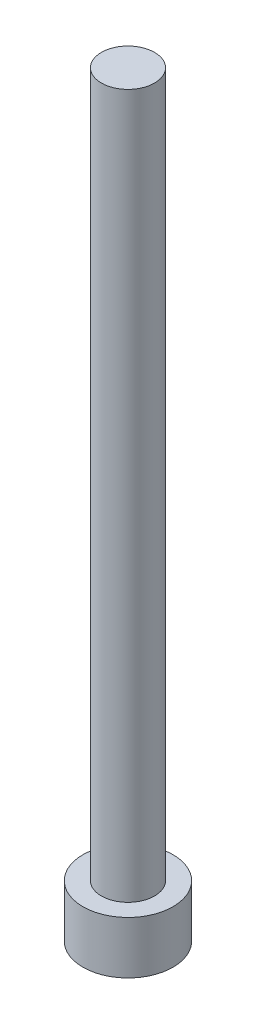
ISO-10303-21;
HEADER;
FILE_DESCRIPTION(('STEP AP214'),'2;1');
FILE_NAME('part.step','',(''),(''),'','','');
FILE_SCHEMA(('AUTOMOTIVE_DESIGN { 1 0 10303 214 1 1 1 1 }'));
ENDSEC;
DATA;
#1=APPLICATION_CONTEXT('core data for automotive mechanical design processes');
#2=APPLICATION_PROTOCOL_DEFINITION('international standard','automotive_design',2000,#1);
#3=PRODUCT_CONTEXT('',#1,'mechanical');
#4=PRODUCT('Part','Part','',(#3));
#5=PRODUCT_RELATED_PRODUCT_CATEGORY('part','',(#4));
#6=PRODUCT_DEFINITION_FORMATION('','',#4);
#7=PRODUCT_DEFINITION_CONTEXT('part definition',#1,'design');
#8=PRODUCT_DEFINITION('design','',#6,#7);
#9=PRODUCT_DEFINITION_SHAPE('','',#8);
#10=(LENGTH_UNIT() NAMED_UNIT(*) SI_UNIT(.MILLI.,.METRE.));
#11=(NAMED_UNIT(*) PLANE_ANGLE_UNIT() SI_UNIT($,.RADIAN.));
#12=(NAMED_UNIT(*) SI_UNIT($,.STERADIAN.) SOLID_ANGLE_UNIT());
#13=UNCERTAINTY_MEASURE_WITH_UNIT(LENGTH_MEASURE(1.E-05),#10,'distance_accuracy_value','');
#14=(GEOMETRIC_REPRESENTATION_CONTEXT(3) GLOBAL_UNCERTAINTY_ASSIGNED_CONTEXT((#13)) GLOBAL_UNIT_ASSIGNED_CONTEXT((#10,
#11,#12)) REPRESENTATION_CONTEXT('',''));
#15=CARTESIAN_POINT('',(0.,0.,0.));
#16=DIRECTION('',(0.,0.,1.));
#17=DIRECTION('',(1.,0.,0.));
#18=AXIS2_PLACEMENT_3D('',#15,#16,#17);
#19=CARTESIAN_POINT('',(0.,7.45,0.));
#20=DIRECTION('',(0.,-1.,0.));
#21=DIRECTION('',(0.,0.,-1.));
#22=AXIS2_PLACEMENT_3D('',#19,#20,#21);
#23=CYLINDRICAL_SURFACE('',#22,6.4);
#24=CARTESIAN_POINT('',(0.,7.45,0.));
#25=DIRECTION('',(0.,1.,0.));
#26=DIRECTION('',(0.,0.,1.));
#27=AXIS2_PLACEMENT_3D('',#24,#25,#26);
#28=CIRCLE('',#27,6.4);
#29=CARTESIAN_POINT('',(0.,7.45,6.4));
#30=VERTEX_POINT('',#29);
#31=EDGE_CURVE('E185',#30,#30,#28,.T.);
#32=ORIENTED_EDGE('',*,*,#31,.F.);
#33=EDGE_LOOP('',(#32));
#34=FACE_BOUND('',#33,.T.);
#35=CARTESIAN_POINT('',(0.,0.,0.));
#36=DIRECTION('',(0.,1.,0.));
#37=DIRECTION('',(0.,0.,1.));
#38=AXIS2_PLACEMENT_3D('',#35,#36,#37);
#39=CIRCLE('',#38,6.4);
#40=CARTESIAN_POINT('',(0.,0.,6.4));
#41=VERTEX_POINT('',#40);
#42=EDGE_CURVE('E188',#41,#41,#39,.T.);
#43=ORIENTED_EDGE('',*,*,#42,.T.);
#44=EDGE_LOOP('',(#43));
#45=FACE_BOUND('',#44,.T.);
#46=ADVANCED_FACE('F45',(#34,#45),#23,.T.);
#47=CARTESIAN_POINT('',(0.,7.45,0.));
#48=DIRECTION('',(0.,1.,0.));
#49=DIRECTION('',(0.,0.,1.));
#50=AXIS2_PLACEMENT_3D('',#47,#48,#49);
#51=PLANE('',#50);
#52=CARTESIAN_POINT('',(0.,7.45,0.));
#53=DIRECTION('',(0.,1.,0.));
#54=DIRECTION('',(0.,0.,1.));
#55=AXIS2_PLACEMENT_3D('',#52,#53,#54);
#56=CIRCLE('',#55,3.775);
#57=CARTESIAN_POINT('',(0.,7.45,3.775));
#58=VERTEX_POINT('',#57);
#59=EDGE_CURVE('E178',#58,#58,#56,.T.);
#60=ORIENTED_EDGE('',*,*,#59,.F.);
#61=EDGE_LOOP('',(#60));
#62=FACE_BOUND('',#61,.T.);
#63=ORIENTED_EDGE('',*,*,#31,.T.);
#64=EDGE_LOOP('',(#63));
#65=FACE_BOUND('',#64,.T.);
#66=ADVANCED_FACE('F330',(#62,#65),#51,.T.);
#67=CARTESIAN_POINT('',(0.,0.,0.));
#68=DIRECTION('',(0.,1.,0.));
#69=DIRECTION('',(0.,0.,1.));
#70=AXIS2_PLACEMENT_3D('',#67,#68,#69);
#71=PLANE('',#70);
#72=DIRECTION('',(0.5,0.,0.866025403784439));
#73=VECTOR('',#72,1.);
#74=CARTESIAN_POINT('',(3.13934208871859,0.,-1.8125));
#75=LINE('',#74,#73);
#76=CARTESIAN_POINT('',(4.18578945162479,0.,0.));
#77=VERTEX_POINT('',#76);
#78=CARTESIAN_POINT('',(2.09289472581239,0.,-3.625));
#79=VERTEX_POINT('',#78);
#80=EDGE_CURVE('E177',#77,#79,#75,.F.);
#81=ORIENTED_EDGE('',*,*,#80,.T.);
#82=DIRECTION('',(1.,0.,0.));
#83=VECTOR('',#82,1.);
#84=CARTESIAN_POINT('',(0.,0.,-3.625));
#85=LINE('',#84,#83);
#86=CARTESIAN_POINT('',(-2.09289472581239,0.,-3.625));
#87=VERTEX_POINT('',#86);
#88=EDGE_CURVE('E160',#79,#87,#85,.F.);
#89=ORIENTED_EDGE('',*,*,#88,.T.);
#90=DIRECTION('',(0.5,0.,-0.866025403784438));
#91=VECTOR('',#90,1.);
#92=CARTESIAN_POINT('',(-3.13934208871859,0.,-1.8125));
#93=LINE('',#92,#91);
#94=CARTESIAN_POINT('',(-4.18578945162479,0.,0.));
#95=VERTEX_POINT('',#94);
#96=EDGE_CURVE('E199',#87,#95,#93,.F.);
#97=ORIENTED_EDGE('',*,*,#96,.T.);
#98=DIRECTION('',(-0.5,0.,-0.866025403784439));
#99=VECTOR('',#98,1.);
#100=CARTESIAN_POINT('',(-3.13934208871859,0.,1.8125));
#101=LINE('',#100,#99);
#102=CARTESIAN_POINT('',(-2.09289472581239,0.,3.625));
#103=VERTEX_POINT('',#102);
#104=EDGE_CURVE('E196',#95,#103,#101,.F.);
#105=ORIENTED_EDGE('',*,*,#104,.T.);
#106=DIRECTION('',(-1.,0.,0.));
#107=VECTOR('',#106,1.);
#108=CARTESIAN_POINT('',(0.,0.,3.625));
#109=LINE('',#108,#107);
#110=CARTESIAN_POINT('',(2.09289472581239,0.,3.625));
#111=VERTEX_POINT('',#110);
#112=EDGE_CURVE('E193',#103,#111,#109,.F.);
#113=ORIENTED_EDGE('',*,*,#112,.T.);
#114=DIRECTION('',(-0.5,0.,0.866025403784439));
#115=VECTOR('',#114,1.);
#116=CARTESIAN_POINT('',(3.13934208871859,0.,1.8125));
#117=LINE('',#116,#115);
#118=EDGE_CURVE('E182',#111,#77,#117,.F.);
#119=ORIENTED_EDGE('',*,*,#118,.T.);
#120=EDGE_LOOP('',(#81,#89,#97,#105,#113,#119));
#121=FACE_BOUND('',#120,.T.);
#122=ORIENTED_EDGE('',*,*,#42,.F.);
#123=EDGE_LOOP('',(#122));
#124=FACE_BOUND('',#123,.T.);
#125=ADVANCED_FACE('F327',(#121,#124),#71,.F.);
#126=CARTESIAN_POINT('',(0.,107.45,0.));
#127=DIRECTION('',(0.,-1.,0.));
#128=DIRECTION('',(0.,0.,-1.));
#129=AXIS2_PLACEMENT_3D('',#126,#127,#128);
#130=CYLINDRICAL_SURFACE('',#129,3.775);
#131=CARTESIAN_POINT('',(0.,107.45,0.));
#132=DIRECTION('',(0.,1.,0.));
#133=DIRECTION('',(0.,0.,1.));
#134=AXIS2_PLACEMENT_3D('',#131,#132,#133);
#135=CIRCLE('',#134,3.775);
#136=CARTESIAN_POINT('',(0.,107.45,3.775));
#137=VERTEX_POINT('',#136);
#138=EDGE_CURVE('E308',#137,#137,#135,.T.);
#139=ORIENTED_EDGE('',*,*,#138,.F.);
#140=EDGE_LOOP('',(#139));
#141=FACE_BOUND('',#140,.T.);
#142=ORIENTED_EDGE('',*,*,#59,.T.);
#143=EDGE_LOOP('',(#142));
#144=FACE_BOUND('',#143,.T.);
#145=ADVANCED_FACE('F329',(#141,#144),#130,.T.);
#146=CARTESIAN_POINT('',(0.,107.45,0.));
#147=DIRECTION('',(0.,1.,0.));
#148=DIRECTION('',(0.,0.,1.));
#149=AXIS2_PLACEMENT_3D('',#146,#147,#148);
#150=PLANE('',#149);
#151=ORIENTED_EDGE('',*,*,#138,.T.);
#152=EDGE_LOOP('',(#151));
#153=FACE_BOUND('',#152,.T.);
#154=ADVANCED_FACE('F338',(#153),#150,.T.);
#155=CARTESIAN_POINT('',(-1.80421959121758,5.,3.125));
#156=DIRECTION('',(-0.866025403784439,0.,0.5));
#157=DIRECTION('',(0.5,0.,0.866025403784439));
#158=AXIS2_PLACEMENT_3D('',#155,#156,#157);
#159=PLANE('',#158);
#160=DIRECTION('',(0.,-1.,0.));
#161=VECTOR('',#160,1.);
#162=CARTESIAN_POINT('',(-3.60843918243516,5.,0.));
#163=LINE('',#162,#161);
#164=CARTESIAN_POINT('',(-3.60843918243516,4.5,0.));
#165=VERTEX_POINT('',#164);
#166=CARTESIAN_POINT('',(-3.60843918243516,0.5,0.));
#167=VERTEX_POINT('',#166);
#168=EDGE_CURVE('E234',#165,#167,#163,.T.);
#169=ORIENTED_EDGE('',*,*,#168,.F.);
#170=DIRECTION('',(-0.5,0.,-0.866025403784439));
#171=VECTOR('',#170,1.);
#172=CARTESIAN_POINT('',(-1.80421959121758,4.5,3.125));
#173=LINE('',#172,#171);
#174=CARTESIAN_POINT('',(-1.80421959121758,4.5,3.125));
#175=VERTEX_POINT('',#174);
#176=EDGE_CURVE('E11',#165,#175,#173,.F.);
#177=ORIENTED_EDGE('',*,*,#176,.T.);
#178=DIRECTION('',(0.,-1.,0.));
#179=VECTOR('',#178,1.);
#180=CARTESIAN_POINT('',(-1.80421959121758,5.,3.125));
#181=LINE('',#180,#179);
#182=CARTESIAN_POINT('',(-1.80421959121758,0.5,3.125));
#183=VERTEX_POINT('',#182);
#184=EDGE_CURVE('E300',#175,#183,#181,.T.);
#185=ORIENTED_EDGE('',*,*,#184,.T.);
#186=DIRECTION('',(-0.5,0.,-0.866025403784439));
#187=VECTOR('',#186,1.);
#188=CARTESIAN_POINT('',(-1.80421959121758,0.5,3.125));
#189=LINE('',#188,#187);
#190=EDGE_CURVE('E207',#183,#167,#189,.T.);
#191=ORIENTED_EDGE('',*,*,#190,.T.);
#192=EDGE_LOOP('',(#169,#177,#185,#191));
#193=FACE_BOUND('',#192,.T.);
#194=ADVANCED_FACE('F436',(#193),#159,.F.);
#195=CARTESIAN_POINT('',(1.80421959121758,5.,3.125));
#196=DIRECTION('',(0.,0.,1.));
#197=DIRECTION('',(1.,0.,0.));
#198=AXIS2_PLACEMENT_3D('',#195,#196,#197);
#199=PLANE('',#198);
#200=ORIENTED_EDGE('',*,*,#184,.F.);
#201=DIRECTION('',(-1.,0.,0.));
#202=VECTOR('',#201,1.);
#203=CARTESIAN_POINT('',(1.80421959121758,4.5,3.125));
#204=LINE('',#203,#202);
#205=CARTESIAN_POINT('',(1.80421959121758,4.5,3.125));
#206=VERTEX_POINT('',#205);
#207=EDGE_CURVE('E261',#175,#206,#204,.F.);
#208=ORIENTED_EDGE('',*,*,#207,.T.);
#209=DIRECTION('',(0.,-1.,0.));
#210=VECTOR('',#209,1.);
#211=CARTESIAN_POINT('',(1.80421959121758,5.,3.125));
#212=LINE('',#211,#210);
#213=CARTESIAN_POINT('',(1.80421959121758,0.5,3.125));
#214=VERTEX_POINT('',#213);
#215=EDGE_CURVE('E299',#206,#214,#212,.T.);
#216=ORIENTED_EDGE('',*,*,#215,.T.);
#217=DIRECTION('',(-1.,0.,0.));
#218=VECTOR('',#217,1.);
#219=CARTESIAN_POINT('',(1.80421959121758,0.5,3.125));
#220=LINE('',#219,#218);
#221=EDGE_CURVE('E211',#214,#183,#220,.T.);
#222=ORIENTED_EDGE('',*,*,#221,.T.);
#223=EDGE_LOOP('',(#200,#208,#216,#222));
#224=FACE_BOUND('',#223,.T.);
#225=ADVANCED_FACE('F298',(#224),#199,.F.);
#226=CARTESIAN_POINT('',(3.60843918243516,5.,0.));
#227=DIRECTION('',(0.866025403784439,0.,0.5));
#228=DIRECTION('',(0.5,0.,-0.866025403784439));
#229=AXIS2_PLACEMENT_3D('',#226,#227,#228);
#230=PLANE('',#229);
#231=ORIENTED_EDGE('',*,*,#215,.F.);
#232=DIRECTION('',(-0.5,0.,0.866025403784439));
#233=VECTOR('',#232,1.);
#234=CARTESIAN_POINT('',(3.60843918243516,4.5,0.));
#235=LINE('',#234,#233);
#236=CARTESIAN_POINT('',(3.60843918243516,4.5,0.));
#237=VERTEX_POINT('',#236);
#238=EDGE_CURVE('E258',#206,#237,#235,.F.);
#239=ORIENTED_EDGE('',*,*,#238,.T.);
#240=DIRECTION('',(0.,-1.,0.));
#241=VECTOR('',#240,1.);
#242=CARTESIAN_POINT('',(3.60843918243516,5.,0.));
#243=LINE('',#242,#241);
#244=CARTESIAN_POINT('',(3.60843918243516,0.5,0.));
#245=VERTEX_POINT('',#244);
#246=EDGE_CURVE('E149',#237,#245,#243,.T.);
#247=ORIENTED_EDGE('',*,*,#246,.T.);
#248=DIRECTION('',(-0.5,0.,0.866025403784439));
#249=VECTOR('',#248,1.);
#250=CARTESIAN_POINT('',(3.60843918243516,0.5,0.));
#251=LINE('',#250,#249);
#252=EDGE_CURVE('E172',#245,#214,#251,.T.);
#253=ORIENTED_EDGE('',*,*,#252,.T.);
#254=EDGE_LOOP('',(#231,#239,#247,#253));
#255=FACE_BOUND('',#254,.T.);
#256=ADVANCED_FACE('F302',(#255),#230,.F.);
#257=CARTESIAN_POINT('',(1.80421959121758,5.,-3.125));
#258=DIRECTION('',(0.866025403784439,0.,-0.5));
#259=DIRECTION('',(-0.5,0.,-0.866025403784439));
#260=AXIS2_PLACEMENT_3D('',#257,#258,#259);
#261=PLANE('',#260);
#262=ORIENTED_EDGE('',*,*,#246,.F.);
#263=DIRECTION('',(0.5,0.,0.866025403784439));
#264=VECTOR('',#263,1.);
#265=CARTESIAN_POINT('',(1.80421959121758,4.5,-3.125));
#266=LINE('',#265,#264);
#267=CARTESIAN_POINT('',(1.80421959121758,4.5,-3.125));
#268=VERTEX_POINT('',#267);
#269=EDGE_CURVE('E143',#237,#268,#266,.F.);
#270=ORIENTED_EDGE('',*,*,#269,.T.);
#271=DIRECTION('',(0.,-1.,0.));
#272=VECTOR('',#271,1.);
#273=CARTESIAN_POINT('',(1.80421959121758,5.,-3.125));
#274=LINE('',#273,#272);
#275=CARTESIAN_POINT('',(1.80421959121758,0.5,-3.125));
#276=VERTEX_POINT('',#275);
#277=EDGE_CURVE('E135',#268,#276,#274,.T.);
#278=ORIENTED_EDGE('',*,*,#277,.T.);
#279=DIRECTION('',(0.5,0.,0.866025403784439));
#280=VECTOR('',#279,1.);
#281=CARTESIAN_POINT('',(1.80421959121758,0.5,-3.125));
#282=LINE('',#281,#280);
#283=EDGE_CURVE('E140',#276,#245,#282,.T.);
#284=ORIENTED_EDGE('',*,*,#283,.T.);
#285=EDGE_LOOP('',(#262,#270,#278,#284));
#286=FACE_BOUND('',#285,.T.);
#287=ADVANCED_FACE('F138',(#286),#261,.F.);
#288=CARTESIAN_POINT('',(-1.80421959121758,5.,-3.125));
#289=DIRECTION('',(0.,0.,-1.));
#290=DIRECTION('',(-1.,0.,0.));
#291=AXIS2_PLACEMENT_3D('',#288,#289,#290);
#292=PLANE('',#291);
#293=ORIENTED_EDGE('',*,*,#277,.F.);
#294=DIRECTION('',(1.,0.,0.));
#295=VECTOR('',#294,1.);
#296=CARTESIAN_POINT('',(-1.80421959121758,4.5,-3.125));
#297=LINE('',#296,#295);
#298=CARTESIAN_POINT('',(-1.80421959121758,4.5,-3.125));
#299=VERTEX_POINT('',#298);
#300=EDGE_CURVE('E253',#268,#299,#297,.F.);
#301=ORIENTED_EDGE('',*,*,#300,.T.);
#302=DIRECTION('',(0.,-1.,0.));
#303=VECTOR('',#302,1.);
#304=CARTESIAN_POINT('',(-1.80421959121758,5.,-3.125));
#305=LINE('',#304,#303);
#306=CARTESIAN_POINT('',(-1.80421959121758,0.5,-3.125));
#307=VERTEX_POINT('',#306);
#308=EDGE_CURVE('E150',#299,#307,#305,.T.);
#309=ORIENTED_EDGE('',*,*,#308,.T.);
#310=DIRECTION('',(1.,0.,0.));
#311=VECTOR('',#310,1.);
#312=CARTESIAN_POINT('',(-1.80421959121758,0.5,-3.125));
#313=LINE('',#312,#311);
#314=EDGE_CURVE('E158',#307,#276,#313,.T.);
#315=ORIENTED_EDGE('',*,*,#314,.T.);
#316=EDGE_LOOP('',(#293,#301,#309,#315));
#317=FACE_BOUND('',#316,.T.);
#318=ADVANCED_FACE('F174',(#317),#292,.F.);
#319=CARTESIAN_POINT('',(-3.60843918243516,5.,0.));
#320=DIRECTION('',(-0.866025403784438,0.,-0.5));
#321=DIRECTION('',(-0.5,0.,0.866025403784438));
#322=AXIS2_PLACEMENT_3D('',#319,#320,#321);
#323=PLANE('',#322);
#324=ORIENTED_EDGE('',*,*,#308,.F.);
#325=DIRECTION('',(0.5,0.,-0.866025403784438));
#326=VECTOR('',#325,1.);
#327=CARTESIAN_POINT('',(-3.60843918243516,4.5,0.));
#328=LINE('',#327,#326);
#329=EDGE_CURVE('E55',#299,#165,#328,.F.);
#330=ORIENTED_EDGE('',*,*,#329,.T.);
#331=ORIENTED_EDGE('',*,*,#168,.T.);
#332=DIRECTION('',(0.5,0.,-0.866025403784438));
#333=VECTOR('',#332,1.);
#334=CARTESIAN_POINT('',(-3.60843918243516,0.5,0.));
#335=LINE('',#334,#333);
#336=EDGE_CURVE('E204',#167,#307,#335,.T.);
#337=ORIENTED_EDGE('',*,*,#336,.T.);
#338=EDGE_LOOP('',(#324,#330,#331,#337));
#339=FACE_BOUND('',#338,.T.);
#340=ADVANCED_FACE('F398',(#339),#323,.F.);
#341=CARTESIAN_POINT('',(0.,5.,0.));
#342=DIRECTION('',(0.,-1.,0.));
#343=DIRECTION('',(0.,0.,-1.));
#344=AXIS2_PLACEMENT_3D('',#341,#342,#343);
#345=PLANE('',#344);
#346=DIRECTION('',(0.5,0.,-0.866025403784438));
#347=VECTOR('',#346,1.);
#348=CARTESIAN_POINT('',(-2.27331668493415,5.,-1.3125));
#349=LINE('',#348,#347);
#350=CARTESIAN_POINT('',(-3.03108891324554,5.,0.));
#351=VERTEX_POINT('',#350);
#352=CARTESIAN_POINT('',(-1.51554445662277,5.,-2.625));
#353=VERTEX_POINT('',#352);
#354=EDGE_CURVE('E237',#351,#353,#349,.T.);
#355=ORIENTED_EDGE('',*,*,#354,.T.);
#356=DIRECTION('',(1.,0.,0.));
#357=VECTOR('',#356,1.);
#358=CARTESIAN_POINT('',(0.,5.,-2.625));
#359=LINE('',#358,#357);
#360=CARTESIAN_POINT('',(1.51554445662277,5.,-2.625));
#361=VERTEX_POINT('',#360);
#362=EDGE_CURVE('E249',#353,#361,#359,.T.);
#363=ORIENTED_EDGE('',*,*,#362,.T.);
#364=DIRECTION('',(0.5,0.,0.866025403784439));
#365=VECTOR('',#364,1.);
#366=CARTESIAN_POINT('',(2.27331668493415,5.,-1.3125));
#367=LINE('',#366,#365);
#368=CARTESIAN_POINT('',(3.03108891324553,5.,0.));
#369=VERTEX_POINT('',#368);
#370=EDGE_CURVE('E246',#361,#369,#367,.T.);
#371=ORIENTED_EDGE('',*,*,#370,.T.);
#372=DIRECTION('',(-0.5,0.,0.866025403784439));
#373=VECTOR('',#372,1.);
#374=CARTESIAN_POINT('',(2.27331668493415,5.,1.3125));
#375=LINE('',#374,#373);
#376=CARTESIAN_POINT('',(1.51554445662277,5.,2.625));
#377=VERTEX_POINT('',#376);
#378=EDGE_CURVE('E243',#369,#377,#375,.T.);
#379=ORIENTED_EDGE('',*,*,#378,.T.);
#380=DIRECTION('',(-1.,0.,0.));
#381=VECTOR('',#380,1.);
#382=CARTESIAN_POINT('',(0.,5.,2.625));
#383=LINE('',#382,#381);
#384=CARTESIAN_POINT('',(-1.51554445662277,5.,2.625));
#385=VERTEX_POINT('',#384);
#386=EDGE_CURVE('E240',#377,#385,#383,.T.);
#387=ORIENTED_EDGE('',*,*,#386,.T.);
#388=DIRECTION('',(-0.5,0.,-0.866025403784439));
#389=VECTOR('',#388,1.);
#390=CARTESIAN_POINT('',(-2.27331668493415,5.,1.3125));
#391=LINE('',#390,#389);
#392=EDGE_CURVE('E171',#385,#351,#391,.T.);
#393=ORIENTED_EDGE('',*,*,#392,.T.);
#394=EDGE_LOOP('',(#355,#363,#371,#379,#387,#393));
#395=FACE_BOUND('',#394,.T.);
#396=ADVANCED_FACE('F368',(#395),#345,.T.);
#397=CARTESIAN_POINT('',(1.80421959121758,0.5,3.625));
#398=DIRECTION('',(-1.,0.,0.));
#399=DIRECTION('',(0.,0.,1.));
#400=AXIS2_PLACEMENT_3D('',#397,#398,#399);
#401=CYLINDRICAL_SURFACE('',#400,0.5);
#402=CARTESIAN_POINT('',(2.09289472581239,0.5,3.625));
#403=DIRECTION('',(-0.866025403784439,0.,0.5));
#404=DIRECTION('',(-0.5,0.,-0.866025403784439));
#405=AXIS2_PLACEMENT_3D('',#402,#403,#404);
#406=ELLIPSE('',#405,0.577350269189626,0.5);
#407=EDGE_CURVE('E226',#111,#214,#406,.F.);
#408=ORIENTED_EDGE('',*,*,#407,.F.);
#409=ORIENTED_EDGE('',*,*,#112,.F.);
#410=CARTESIAN_POINT('',(-2.09289472581239,0.5,3.625));
#411=DIRECTION('',(-0.866025403784438,0.,-0.5));
#412=DIRECTION('',(0.5,0.,-0.866025403784439));
#413=AXIS2_PLACEMENT_3D('',#410,#411,#412);
#414=ELLIPSE('',#413,0.577350269189626,0.5);
#415=EDGE_CURVE('E230',#183,#103,#414,.T.);
#416=ORIENTED_EDGE('',*,*,#415,.F.);
#417=ORIENTED_EDGE('',*,*,#221,.F.);
#418=EDGE_LOOP('',(#408,#409,#416,#417));
#419=FACE_BOUND('',#418,.T.);
#420=ADVANCED_FACE('F365',(#419),#401,.T.);
#421=CARTESIAN_POINT('',(-2.2372322931098,0.5,3.375));
#422=DIRECTION('',(-0.5,0.,-0.866025403784439));
#423=DIRECTION('',(-0.866025403784439,0.,0.5));
#424=AXIS2_PLACEMENT_3D('',#421,#422,#423);
#425=CYLINDRICAL_SURFACE('',#424,0.5);
#426=ORIENTED_EDGE('',*,*,#415,.T.);
#427=ORIENTED_EDGE('',*,*,#104,.F.);
#428=CARTESIAN_POINT('',(-4.18578945162479,0.5,0.));
#429=DIRECTION('',(0.,0.,-1.));
#430=DIRECTION('',(1.,0.,0.));
#431=AXIS2_PLACEMENT_3D('',#428,#429,#430);
#432=ELLIPSE('',#431,0.577350269189626,0.5);
#433=EDGE_CURVE('E222',#167,#95,#432,.T.);
#434=ORIENTED_EDGE('',*,*,#433,.F.);
#435=ORIENTED_EDGE('',*,*,#190,.F.);
#436=EDGE_LOOP('',(#426,#427,#434,#435));
#437=FACE_BOUND('',#436,.T.);
#438=ADVANCED_FACE('F361',(#437),#425,.T.);
#439=CARTESIAN_POINT('',(4.04145188432738,0.5,0.25));
#440=DIRECTION('',(-0.5,0.,0.866025403784439));
#441=DIRECTION('',(0.866025403784439,0.,0.5));
#442=AXIS2_PLACEMENT_3D('',#439,#440,#441);
#443=CYLINDRICAL_SURFACE('',#442,0.5);
#444=ORIENTED_EDGE('',*,*,#407,.T.);
#445=ORIENTED_EDGE('',*,*,#252,.F.);
#446=CARTESIAN_POINT('',(4.18578945162479,0.5,0.));
#447=DIRECTION('',(0.,0.,1.));
#448=DIRECTION('',(-1.,0.,0.));
#449=AXIS2_PLACEMENT_3D('',#446,#447,#448);
#450=ELLIPSE('',#449,0.577350269189626,0.5);
#451=EDGE_CURVE('E169',#77,#245,#450,.F.);
#452=ORIENTED_EDGE('',*,*,#451,.F.);
#453=ORIENTED_EDGE('',*,*,#118,.F.);
#454=EDGE_LOOP('',(#444,#445,#452,#453));
#455=FACE_BOUND('',#454,.T.);
#456=ADVANCED_FACE('F357',(#455),#443,.T.);
#457=CARTESIAN_POINT('',(-4.04145188432738,0.5,-0.250000000000001));
#458=DIRECTION('',(0.5,0.,-0.866025403784438));
#459=DIRECTION('',(-0.866025403784438,0.,-0.5));
#460=AXIS2_PLACEMENT_3D('',#457,#458,#459);
#461=CYLINDRICAL_SURFACE('',#460,0.5);
#462=ORIENTED_EDGE('',*,*,#433,.T.);
#463=ORIENTED_EDGE('',*,*,#96,.F.);
#464=CARTESIAN_POINT('',(-2.09289472581239,0.5,-3.625));
#465=DIRECTION('',(0.866025403784439,0.,-0.5));
#466=DIRECTION('',(0.5,0.,0.866025403784439));
#467=AXIS2_PLACEMENT_3D('',#464,#465,#466);
#468=ELLIPSE('',#467,0.577350269189626,0.5);
#469=EDGE_CURVE('E164',#307,#87,#468,.T.);
#470=ORIENTED_EDGE('',*,*,#469,.F.);
#471=ORIENTED_EDGE('',*,*,#336,.F.);
#472=EDGE_LOOP('',(#462,#463,#470,#471));
#473=FACE_BOUND('',#472,.T.);
#474=ADVANCED_FACE('F354',(#473),#461,.T.);
#475=CARTESIAN_POINT('',(2.2372322931098,0.5,-3.375));
#476=DIRECTION('',(0.5,0.,0.866025403784439));
#477=DIRECTION('',(0.866025403784439,0.,-0.5));
#478=AXIS2_PLACEMENT_3D('',#475,#476,#477);
#479=CYLINDRICAL_SURFACE('',#478,0.5);
#480=ORIENTED_EDGE('',*,*,#451,.T.);
#481=ORIENTED_EDGE('',*,*,#283,.F.);
#482=CARTESIAN_POINT('',(2.09289472581239,0.5,-3.625));
#483=DIRECTION('',(0.866025403784439,0.,0.5));
#484=DIRECTION('',(0.5,0.,-0.866025403784439));
#485=AXIS2_PLACEMENT_3D('',#482,#483,#484);
#486=ELLIPSE('',#485,0.577350269189626,0.5);
#487=EDGE_CURVE('E156',#79,#276,#486,.F.);
#488=ORIENTED_EDGE('',*,*,#487,.F.);
#489=ORIENTED_EDGE('',*,*,#80,.F.);
#490=EDGE_LOOP('',(#480,#481,#488,#489));
#491=FACE_BOUND('',#490,.T.);
#492=ADVANCED_FACE('F167',(#491),#479,.T.);
#493=CARTESIAN_POINT('',(-1.80421959121758,0.5,-3.625));
#494=DIRECTION('',(1.,0.,0.));
#495=DIRECTION('',(0.,0.,-1.));
#496=AXIS2_PLACEMENT_3D('',#493,#494,#495);
#497=CYLINDRICAL_SURFACE('',#496,0.5);
#498=ORIENTED_EDGE('',*,*,#469,.T.);
#499=ORIENTED_EDGE('',*,*,#88,.F.);
#500=ORIENTED_EDGE('',*,*,#487,.T.);
#501=ORIENTED_EDGE('',*,*,#314,.F.);
#502=EDGE_LOOP('',(#498,#499,#500,#501));
#503=FACE_BOUND('',#502,.T.);
#504=ADVANCED_FACE('F157',(#503),#497,.T.);
#505=CARTESIAN_POINT('',(0.,4.5,2.625));
#506=DIRECTION('',(-1.,0.,0.));
#507=DIRECTION('',(0.,0.,1.));
#508=AXIS2_PLACEMENT_3D('',#505,#506,#507);
#509=CYLINDRICAL_SURFACE('',#508,0.5);
#510=CARTESIAN_POINT('',(1.51554445662277,4.5,2.625));
#511=DIRECTION('',(-0.866025403784439,0.,0.5));
#512=DIRECTION('',(0.5,0.,0.866025403784439));
#513=AXIS2_PLACEMENT_3D('',#510,#511,#512);
#514=ELLIPSE('',#513,0.577350269189626,0.5);
#515=EDGE_CURVE('E279',#206,#377,#514,.T.);
#516=ORIENTED_EDGE('',*,*,#515,.F.);
#517=ORIENTED_EDGE('',*,*,#207,.F.);
#518=CARTESIAN_POINT('',(-1.51554445662277,4.5,2.625));
#519=DIRECTION('',(-0.866025403784438,0.,-0.5));
#520=DIRECTION('',(-0.5,0.,0.866025403784439));
#521=AXIS2_PLACEMENT_3D('',#518,#519,#520);
#522=ELLIPSE('',#521,0.577350269189626,0.5);
#523=EDGE_CURVE('E49',#385,#175,#522,.F.);
#524=ORIENTED_EDGE('',*,*,#523,.F.);
#525=ORIENTED_EDGE('',*,*,#386,.F.);
#526=EDGE_LOOP('',(#516,#517,#524,#525));
#527=FACE_BOUND('',#526,.T.);
#528=ADVANCED_FACE('F47',(#527),#509,.F.);
#529=CARTESIAN_POINT('',(-2.27331668493415,4.5,1.3125));
#530=DIRECTION('',(-0.5,0.,-0.866025403784439));
#531=DIRECTION('',(-0.866025403784439,0.,0.5));
#532=AXIS2_PLACEMENT_3D('',#529,#530,#531);
#533=CYLINDRICAL_SURFACE('',#532,0.5);
#534=ORIENTED_EDGE('',*,*,#523,.T.);
#535=ORIENTED_EDGE('',*,*,#176,.F.);
#536=CARTESIAN_POINT('',(-3.03108891324554,4.5,0.));
#537=DIRECTION('',(0.,0.,-1.));
#538=DIRECTION('',(1.,0.,0.));
#539=AXIS2_PLACEMENT_3D('',#536,#537,#538);
#540=ELLIPSE('',#539,0.577350269189626,0.5);
#541=EDGE_CURVE('E276',#351,#165,#540,.F.);
#542=ORIENTED_EDGE('',*,*,#541,.F.);
#543=ORIENTED_EDGE('',*,*,#392,.F.);
#544=EDGE_LOOP('',(#534,#535,#542,#543));
#545=FACE_BOUND('',#544,.T.);
#546=ADVANCED_FACE('F291',(#545),#533,.F.);
#547=CARTESIAN_POINT('',(2.27331668493415,4.5,1.3125));
#548=DIRECTION('',(-0.5,0.,0.866025403784439));
#549=DIRECTION('',(0.866025403784439,0.,0.5));
#550=AXIS2_PLACEMENT_3D('',#547,#548,#549);
#551=CYLINDRICAL_SURFACE('',#550,0.5);
#552=ORIENTED_EDGE('',*,*,#515,.T.);
#553=ORIENTED_EDGE('',*,*,#378,.F.);
#554=CARTESIAN_POINT('',(3.03108891324553,4.5,0.));
#555=DIRECTION('',(0.,0.,1.));
#556=DIRECTION('',(1.,0.,0.));
#557=AXIS2_PLACEMENT_3D('',#554,#555,#556);
#558=ELLIPSE('',#557,0.577350269189626,0.5);
#559=EDGE_CURVE('E272',#237,#369,#558,.T.);
#560=ORIENTED_EDGE('',*,*,#559,.F.);
#561=ORIENTED_EDGE('',*,*,#238,.F.);
#562=EDGE_LOOP('',(#552,#553,#560,#561));
#563=FACE_BOUND('',#562,.T.);
#564=ADVANCED_FACE('F381',(#563),#551,.F.);
#565=CARTESIAN_POINT('',(-2.27331668493415,4.5,-1.3125));
#566=DIRECTION('',(0.5,0.,-0.866025403784438));
#567=DIRECTION('',(-0.866025403784438,0.,-0.5));
#568=AXIS2_PLACEMENT_3D('',#565,#566,#567);
#569=CYLINDRICAL_SURFACE('',#568,0.5);
#570=ORIENTED_EDGE('',*,*,#541,.T.);
#571=ORIENTED_EDGE('',*,*,#329,.F.);
#572=CARTESIAN_POINT('',(-1.51554445662277,4.5,-2.625));
#573=DIRECTION('',(0.866025403784439,0.,-0.5));
#574=DIRECTION('',(0.5,0.,0.866025403784439));
#575=AXIS2_PLACEMENT_3D('',#572,#573,#574);
#576=ELLIPSE('',#575,0.577350269189626,0.5);
#577=EDGE_CURVE('E269',#353,#299,#576,.F.);
#578=ORIENTED_EDGE('',*,*,#577,.F.);
#579=ORIENTED_EDGE('',*,*,#354,.F.);
#580=EDGE_LOOP('',(#570,#571,#578,#579));
#581=FACE_BOUND('',#580,.T.);
#582=ADVANCED_FACE('F377',(#581),#569,.F.);
#583=CARTESIAN_POINT('',(2.27331668493415,4.5,-1.3125));
#584=DIRECTION('',(0.5,0.,0.866025403784439));
#585=DIRECTION('',(0.866025403784439,0.,-0.5));
#586=AXIS2_PLACEMENT_3D('',#583,#584,#585);
#587=CYLINDRICAL_SURFACE('',#586,0.5);
#588=ORIENTED_EDGE('',*,*,#559,.T.);
#589=ORIENTED_EDGE('',*,*,#370,.F.);
#590=CARTESIAN_POINT('',(1.51554445662277,4.5,-2.625));
#591=DIRECTION('',(0.866025403784439,0.,0.5));
#592=DIRECTION('',(0.5,0.,-0.866025403784439));
#593=AXIS2_PLACEMENT_3D('',#590,#591,#592);
#594=ELLIPSE('',#593,0.577350269189626,0.5);
#595=EDGE_CURVE('E266',#268,#361,#594,.T.);
#596=ORIENTED_EDGE('',*,*,#595,.F.);
#597=ORIENTED_EDGE('',*,*,#269,.F.);
#598=EDGE_LOOP('',(#588,#589,#596,#597));
#599=FACE_BOUND('',#598,.T.);
#600=ADVANCED_FACE('F373',(#599),#587,.F.);
#601=CARTESIAN_POINT('',(0.,4.5,-2.625));
#602=DIRECTION('',(1.,0.,0.));
#603=DIRECTION('',(0.,0.,-1.));
#604=AXIS2_PLACEMENT_3D('',#601,#602,#603);
#605=CYLINDRICAL_SURFACE('',#604,0.5);
#606=ORIENTED_EDGE('',*,*,#577,.T.);
#607=ORIENTED_EDGE('',*,*,#300,.F.);
#608=ORIENTED_EDGE('',*,*,#595,.T.);
#609=ORIENTED_EDGE('',*,*,#362,.F.);
#610=EDGE_LOOP('',(#606,#607,#608,#609));
#611=FACE_BOUND('',#610,.T.);
#612=ADVANCED_FACE('F370',(#611),#605,.F.);
#613=CLOSED_SHELL('',(#46,#66,#125,#145,#154,#194,#225,#256,#287,#318,#340,#396,#420,#438,#456,
#474,#492,#504,#528,#546,#564,#582,#600,#612));
#614=MANIFOLD_SOLID_BREP('B2',#613);
#615=ADVANCED_BREP_SHAPE_REPRESENTATION('',(#18,#614),#14);
#616=SHAPE_DEFINITION_REPRESENTATION(#9,#615);
ENDSEC;
END-ISO-10303-21;
